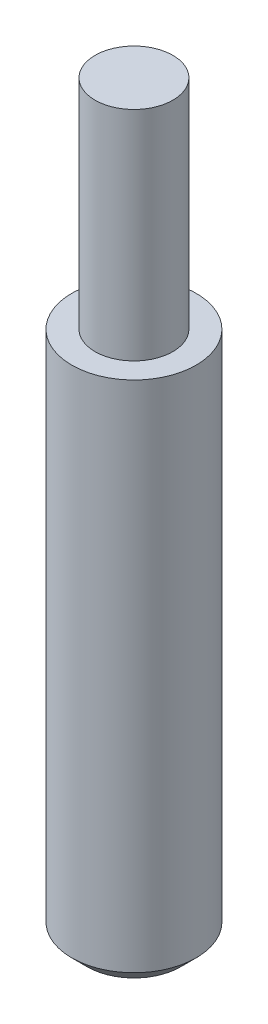
ISO-10303-21;
HEADER;
FILE_DESCRIPTION(('STEP AP214'),'2;1');
FILE_NAME('part.step','',(''),(''),'','','');
FILE_SCHEMA(('AUTOMOTIVE_DESIGN { 1 0 10303 214 1 1 1 1 }'));
ENDSEC;
DATA;
#1=APPLICATION_CONTEXT('core data for automotive mechanical design processes');
#2=APPLICATION_PROTOCOL_DEFINITION('international standard','automotive_design',2000,#1);
#3=PRODUCT_CONTEXT('',#1,'mechanical');
#4=PRODUCT('Part','Part','',(#3));
#5=PRODUCT_RELATED_PRODUCT_CATEGORY('part','',(#4));
#6=PRODUCT_DEFINITION_FORMATION('','',#4);
#7=PRODUCT_DEFINITION_CONTEXT('part definition',#1,'design');
#8=PRODUCT_DEFINITION('design','',#6,#7);
#9=PRODUCT_DEFINITION_SHAPE('','',#8);
#10=(LENGTH_UNIT() NAMED_UNIT(*) SI_UNIT(.MILLI.,.METRE.));
#11=(NAMED_UNIT(*) PLANE_ANGLE_UNIT() SI_UNIT($,.RADIAN.));
#12=(NAMED_UNIT(*) SI_UNIT($,.STERADIAN.) SOLID_ANGLE_UNIT());
#13=UNCERTAINTY_MEASURE_WITH_UNIT(LENGTH_MEASURE(1.E-05),#10,'distance_accuracy_value','');
#14=(GEOMETRIC_REPRESENTATION_CONTEXT(3) GLOBAL_UNCERTAINTY_ASSIGNED_CONTEXT((#13)) GLOBAL_UNIT_ASSIGNED_CONTEXT((#10,
#11,#12)) REPRESENTATION_CONTEXT('',''));
#15=CARTESIAN_POINT('',(0.,0.,0.));
#16=DIRECTION('',(0.,0.,1.));
#17=DIRECTION('',(1.,0.,0.));
#18=AXIS2_PLACEMENT_3D('',#15,#16,#17);
#19=CARTESIAN_POINT('',(0.,1219.2,0.));
#20=DIRECTION('',(0.,-1.,0.));
#21=DIRECTION('',(0.,0.,-1.));
#22=AXIS2_PLACEMENT_3D('',#19,#20,#21);
#23=CYLINDRICAL_SURFACE('',#22,101.6);
#24=CARTESIAN_POINT('',(0.,25.4000000000008,0.));
#25=DIRECTION('',(0.,1.,0.));
#26=DIRECTION('',(0.,0.,1.));
#27=AXIS2_PLACEMENT_3D('',#24,#25,#26);
#28=CIRCLE('',#27,101.6);
#29=CARTESIAN_POINT('',(0.,25.4000000000008,101.6));
#30=VERTEX_POINT('',#29);
#31=EDGE_CURVE('E37',#30,#30,#28,.T.);
#32=ORIENTED_EDGE('',*,*,#31,.T.);
#33=EDGE_LOOP('',(#32));
#34=FACE_BOUND('',#33,.T.);
#35=CARTESIAN_POINT('',(0.,863.6,0.));
#36=DIRECTION('',(0.,1.,0.));
#37=DIRECTION('',(0.,0.,1.));
#38=AXIS2_PLACEMENT_3D('',#35,#36,#37);
#39=CIRCLE('',#38,101.6);
#40=CARTESIAN_POINT('',(0.,863.6,101.6));
#41=VERTEX_POINT('',#40);
#42=EDGE_CURVE('E41',#41,#41,#39,.T.);
#43=ORIENTED_EDGE('',*,*,#42,.F.);
#44=EDGE_LOOP('',(#43));
#45=FACE_BOUND('',#44,.T.);
#46=ADVANCED_FACE('F30',(#34,#45),#23,.T.);
#47=CARTESIAN_POINT('',(0.,0.,0.));
#48=DIRECTION('',(0.,1.,0.));
#49=DIRECTION('',(0.,0.,1.));
#50=AXIS2_PLACEMENT_3D('',#47,#48,#49);
#51=PLANE('',#50);
#52=CARTESIAN_POINT('',(0.,0.,0.));
#53=DIRECTION('',(0.,1.,0.));
#54=DIRECTION('',(0.,0.,1.));
#55=AXIS2_PLACEMENT_3D('',#52,#53,#54);
#56=CIRCLE('',#55,76.199999999999);
#57=CARTESIAN_POINT('',(0.,0.,76.199999999999));
#58=VERTEX_POINT('',#57);
#59=EDGE_CURVE('E11',#58,#58,#56,.F.);
#60=ORIENTED_EDGE('',*,*,#59,.T.);
#61=EDGE_LOOP('',(#60));
#62=FACE_BOUND('',#61,.T.);
#63=ADVANCED_FACE('F60',(#62),#51,.F.);
#64=CARTESIAN_POINT('',(0.,863.6,0.));
#65=DIRECTION('',(0.,1.,0.));
#66=DIRECTION('',(0.,0.,1.));
#67=AXIS2_PLACEMENT_3D('',#64,#65,#66);
#68=PLANE('',#67);
#69=CARTESIAN_POINT('',(0.,863.6,0.));
#70=DIRECTION('',(0.,1.,0.));
#71=DIRECTION('',(0.,0.,1.));
#72=AXIS2_PLACEMENT_3D('',#69,#70,#71);
#73=CIRCLE('',#72,63.5);
#74=CARTESIAN_POINT('',(0.,863.6,63.5));
#75=VERTEX_POINT('',#74);
#76=EDGE_CURVE('E45',#75,#75,#73,.T.);
#77=ORIENTED_EDGE('',*,*,#76,.F.);
#78=EDGE_LOOP('',(#77));
#79=FACE_BOUND('',#78,.T.);
#80=ORIENTED_EDGE('',*,*,#42,.T.);
#81=EDGE_LOOP('',(#80));
#82=FACE_BOUND('',#81,.T.);
#83=ADVANCED_FACE('F57',(#79,#82),#68,.T.);
#84=CARTESIAN_POINT('',(0.,863.6,0.));
#85=DIRECTION('',(0.,1.,0.));
#86=DIRECTION('',(0.,0.,1.));
#87=AXIS2_PLACEMENT_3D('',#84,#85,#86);
#88=CYLINDRICAL_SURFACE('',#87,63.5);
#89=ORIENTED_EDGE('',*,*,#76,.T.);
#90=EDGE_LOOP('',(#89));
#91=FACE_BOUND('',#90,.T.);
#92=CARTESIAN_POINT('',(0.,1219.2,0.));
#93=DIRECTION('',(0.,1.,0.));
#94=DIRECTION('',(0.,0.,1.));
#95=AXIS2_PLACEMENT_3D('',#92,#93,#94);
#96=CIRCLE('',#95,63.5);
#97=CARTESIAN_POINT('',(0.,1219.2,63.5));
#98=VERTEX_POINT('',#97);
#99=EDGE_CURVE('E48',#98,#98,#96,.T.);
#100=ORIENTED_EDGE('',*,*,#99,.F.);
#101=EDGE_LOOP('',(#100));
#102=FACE_BOUND('',#101,.T.);
#103=ADVANCED_FACE('F54',(#91,#102),#88,.T.);
#104=CARTESIAN_POINT('',(0.,1219.2,0.));
#105=DIRECTION('',(0.,1.,0.));
#106=DIRECTION('',(0.,0.,1.));
#107=AXIS2_PLACEMENT_3D('',#104,#105,#106);
#108=PLANE('',#107);
#109=ORIENTED_EDGE('',*,*,#99,.T.);
#110=EDGE_LOOP('',(#109));
#111=FACE_BOUND('',#110,.T.);
#112=ADVANCED_FACE('F70',(#111),#108,.T.);
#113=CARTESIAN_POINT('',(0.,25.4000000000008,0.));
#114=DIRECTION('',(0.,1.,0.));
#115=DIRECTION('',(0.,0.,1.));
#116=AXIS2_PLACEMENT_3D('',#113,#114,#115);
#117=CONICAL_SURFACE('',#116,101.6,0.785398163397452);
#118=ORIENTED_EDGE('',*,*,#59,.F.);
#119=EDGE_LOOP('',(#118));
#120=FACE_BOUND('',#119,.T.);
#121=ORIENTED_EDGE('',*,*,#31,.F.);
#122=EDGE_LOOP('',(#121));
#123=FACE_BOUND('',#122,.T.);
#124=ADVANCED_FACE('F32',(#120,#123),#117,.T.);
#125=CLOSED_SHELL('',(#46,#63,#83,#103,#112,#124));
#126=MANIFOLD_SOLID_BREP('B2',#125);
#127=ADVANCED_BREP_SHAPE_REPRESENTATION('',(#18,#126),#14);
#128=SHAPE_DEFINITION_REPRESENTATION(#9,#127);
ENDSEC;
END-ISO-10303-21;
